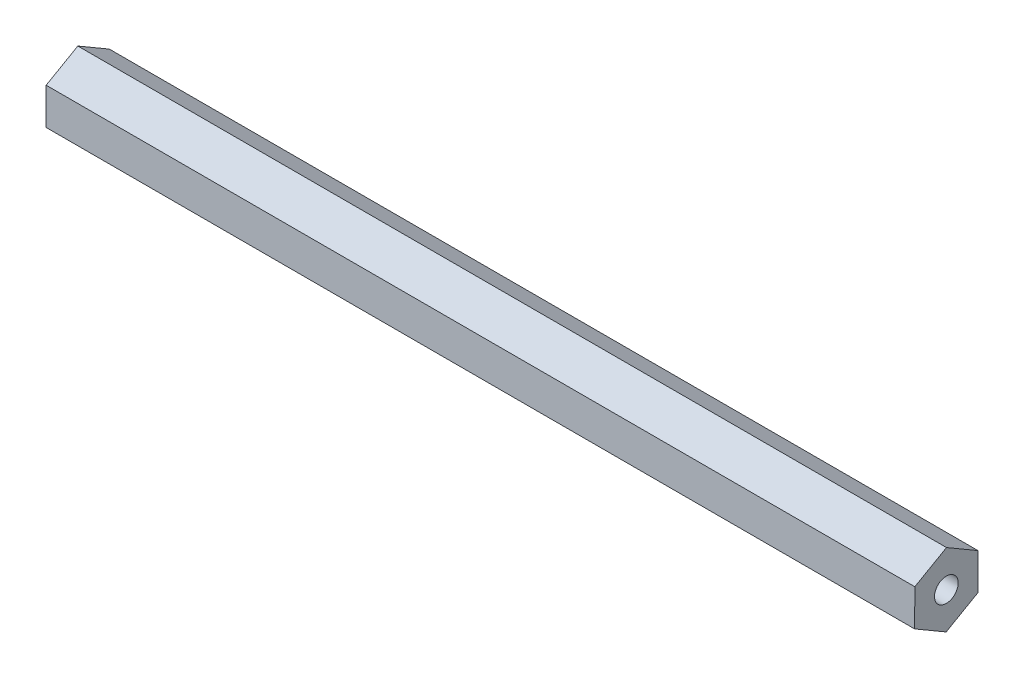
ISO-10303-21;
HEADER;
FILE_DESCRIPTION(('STEP AP214'),'2;1');
FILE_NAME('part.step','',(''),(''),'','','');
FILE_SCHEMA(('AUTOMOTIVE_DESIGN { 1 0 10303 214 1 1 1 1 }'));
ENDSEC;
DATA;
#1=APPLICATION_CONTEXT('core data for automotive mechanical design processes');
#2=APPLICATION_PROTOCOL_DEFINITION('international standard','automotive_design',2000,#1);
#3=PRODUCT_CONTEXT('',#1,'mechanical');
#4=PRODUCT('Part','Part','',(#3));
#5=PRODUCT_RELATED_PRODUCT_CATEGORY('part','',(#4));
#6=PRODUCT_DEFINITION_FORMATION('','',#4);
#7=PRODUCT_DEFINITION_CONTEXT('part definition',#1,'design');
#8=PRODUCT_DEFINITION('design','',#6,#7);
#9=PRODUCT_DEFINITION_SHAPE('','',#8);
#10=(LENGTH_UNIT() NAMED_UNIT(*) SI_UNIT(.MILLI.,.METRE.));
#11=(NAMED_UNIT(*) PLANE_ANGLE_UNIT() SI_UNIT($,.RADIAN.));
#12=(NAMED_UNIT(*) SI_UNIT($,.STERADIAN.) SOLID_ANGLE_UNIT());
#13=UNCERTAINTY_MEASURE_WITH_UNIT(LENGTH_MEASURE(1.E-05),#10,'distance_accuracy_value','');
#14=(GEOMETRIC_REPRESENTATION_CONTEXT(3) GLOBAL_UNCERTAINTY_ASSIGNED_CONTEXT((#13)) GLOBAL_UNIT_ASSIGNED_CONTEXT((#10,
#11,#12)) REPRESENTATION_CONTEXT('',''));
#15=CARTESIAN_POINT('',(0.,0.,0.));
#16=DIRECTION('',(0.,0.,1.));
#17=DIRECTION('',(1.,0.,0.));
#18=AXIS2_PLACEMENT_3D('',#15,#16,#17);
#19=CARTESIAN_POINT('',(174.625,0.,0.));
#20=DIRECTION('',(1.,0.,0.));
#21=DIRECTION('',(0.,0.,-1.));
#22=AXIS2_PLACEMENT_3D('',#19,#20,#21);
#23=PLANE('',#22);
#24=DIRECTION('',(0.,0.999990086919822,-0.00445264663856445));
#25=VECTOR('',#24,1.);
#26=CARTESIAN_POINT('',(174.625,-3.69441217243012,-6.33361287367119));
#27=LINE('',#26,#25);
#28=CARTESIAN_POINT('',(174.625,-3.69441217243012,-6.33361287367119));
#29=VERTEX_POINT('',#28);
#30=CARTESIAN_POINT('',(174.625,3.63786356012036,-6.36626123021054));
#31=VERTEX_POINT('',#30);
#32=EDGE_CURVE('E157',#29,#31,#27,.T.);
#33=ORIENTED_EDGE('',*,*,#32,.T.);
#34=DIRECTION('',(0.,0.503851148562983,0.863790495485892));
#35=VECTOR('',#34,1.);
#36=CARTESIAN_POINT('',(174.625,3.63786356012036,-6.36626123021054));
#37=LINE('',#36,#35);
#38=CARTESIAN_POINT('',(174.625,7.33227573255048,-0.0326483565393466));
#39=VERTEX_POINT('',#38);
#40=EDGE_CURVE('E114',#31,#39,#37,.T.);
#41=ORIENTED_EDGE('',*,*,#40,.T.);
#42=DIRECTION('',(0.,-0.496138938356838,0.868243142124457));
#43=VECTOR('',#42,1.);
#44=CARTESIAN_POINT('',(174.625,7.33227573255048,-0.0326483565393466));
#45=LINE('',#44,#43);
#46=CARTESIAN_POINT('',(174.625,3.69441217243012,6.33361287367119));
#47=VERTEX_POINT('',#46);
#48=EDGE_CURVE('E130',#39,#47,#45,.T.);
#49=ORIENTED_EDGE('',*,*,#48,.T.);
#50=DIRECTION('',(0.,-0.999990086919821,0.00445264663856468));
#51=VECTOR('',#50,1.);
#52=CARTESIAN_POINT('',(174.625,3.69441217243012,6.33361287367119));
#53=LINE('',#52,#51);
#54=CARTESIAN_POINT('',(174.625,-3.63786356012035,6.36626123021054));
#55=VERTEX_POINT('',#54);
#56=EDGE_CURVE('E123',#47,#55,#53,.T.);
#57=ORIENTED_EDGE('',*,*,#56,.T.);
#58=DIRECTION('',(0.,-0.503851148562983,-0.863790495485892));
#59=VECTOR('',#58,1.);
#60=CARTESIAN_POINT('',(174.625,-3.63786356012035,6.36626123021054));
#61=LINE('',#60,#59);
#62=CARTESIAN_POINT('',(174.625,-7.33227573255048,0.0326483565393424));
#63=VERTEX_POINT('',#62);
#64=EDGE_CURVE('E124',#55,#63,#61,.T.);
#65=ORIENTED_EDGE('',*,*,#64,.T.);
#66=DIRECTION('',(0.,0.496138938356839,-0.868243142124457));
#67=VECTOR('',#66,1.);
#68=CARTESIAN_POINT('',(174.625,-7.33227573255048,0.0326483565393424));
#69=LINE('',#68,#67);
#70=EDGE_CURVE('E77',#63,#29,#69,.T.);
#71=ORIENTED_EDGE('',*,*,#70,.T.);
#72=EDGE_LOOP('',(#33,#41,#49,#57,#65,#71));
#73=FACE_BOUND('',#72,.T.);
#74=CARTESIAN_POINT('',(174.625,0.,0.));
#75=DIRECTION('',(1.,0.,0.));
#76=DIRECTION('',(0.,0.,-1.));
#77=AXIS2_PLACEMENT_3D('',#74,#75,#76);
#78=CIRCLE('',#77,2.38125);
#79=CARTESIAN_POINT('',(174.625,0.,-2.38125));
#80=VERTEX_POINT('',#79);
#81=EDGE_CURVE('E146',#80,#80,#78,.T.);
#82=ORIENTED_EDGE('',*,*,#81,.F.);
#83=EDGE_LOOP('',(#82));
#84=FACE_BOUND('',#83,.T.);
#85=ADVANCED_FACE('F58',(#73,#84),#23,.T.);
#86=CARTESIAN_POINT('',(0.,0.,0.));
#87=DIRECTION('',(1.,0.,0.));
#88=DIRECTION('',(0.,0.,-1.));
#89=AXIS2_PLACEMENT_3D('',#86,#87,#88);
#90=PLANE('',#89);
#91=DIRECTION('',(0.,0.999990086919822,-0.00445264663856445));
#92=VECTOR('',#91,1.);
#93=CARTESIAN_POINT('',(0.,-3.69441217243012,-6.33361287367119));
#94=LINE('',#93,#92);
#95=CARTESIAN_POINT('',(0.,-3.69441217243012,-6.33361287367119));
#96=VERTEX_POINT('',#95);
#97=CARTESIAN_POINT('',(0.,3.63786356012036,-6.36626123021054));
#98=VERTEX_POINT('',#97);
#99=EDGE_CURVE('E144',#96,#98,#94,.T.);
#100=ORIENTED_EDGE('',*,*,#99,.F.);
#101=DIRECTION('',(0.,0.496138938356839,-0.868243142124457));
#102=VECTOR('',#101,1.);
#103=CARTESIAN_POINT('',(0.,-7.33227573255048,0.0326483565393424));
#104=LINE('',#103,#102);
#105=CARTESIAN_POINT('',(0.,-7.33227573255048,0.0326483565393424));
#106=VERTEX_POINT('',#105);
#107=EDGE_CURVE('E107',#106,#96,#104,.T.);
#108=ORIENTED_EDGE('',*,*,#107,.F.);
#109=DIRECTION('',(0.,-0.503851148562983,-0.863790495485892));
#110=VECTOR('',#109,1.);
#111=CARTESIAN_POINT('',(0.,-3.63786356012035,6.36626123021054));
#112=LINE('',#111,#110);
#113=CARTESIAN_POINT('',(0.,-3.63786356012035,6.36626123021054));
#114=VERTEX_POINT('',#113);
#115=EDGE_CURVE('E99',#114,#106,#112,.T.);
#116=ORIENTED_EDGE('',*,*,#115,.F.);
#117=DIRECTION('',(0.,-0.999990086919821,0.00445264663856468));
#118=VECTOR('',#117,1.);
#119=CARTESIAN_POINT('',(0.,3.69441217243012,6.33361287367119));
#120=LINE('',#119,#118);
#121=CARTESIAN_POINT('',(0.,3.69441217243012,6.33361287367119));
#122=VERTEX_POINT('',#121);
#123=EDGE_CURVE('E134',#122,#114,#120,.T.);
#124=ORIENTED_EDGE('',*,*,#123,.F.);
#125=DIRECTION('',(0.,-0.496138938356838,0.868243142124457));
#126=VECTOR('',#125,1.);
#127=CARTESIAN_POINT('',(0.,7.33227573255048,-0.0326483565393466));
#128=LINE('',#127,#126);
#129=CARTESIAN_POINT('',(0.,7.33227573255048,-0.0326483565393466));
#130=VERTEX_POINT('',#129);
#131=EDGE_CURVE('E152',#130,#122,#128,.T.);
#132=ORIENTED_EDGE('',*,*,#131,.F.);
#133=DIRECTION('',(0.,0.503851148562983,0.863790495485892));
#134=VECTOR('',#133,1.);
#135=CARTESIAN_POINT('',(0.,3.63786356012036,-6.36626123021054));
#136=LINE('',#135,#134);
#137=EDGE_CURVE('E149',#98,#130,#136,.T.);
#138=ORIENTED_EDGE('',*,*,#137,.F.);
#139=EDGE_LOOP('',(#100,#108,#116,#124,#132,#138));
#140=FACE_BOUND('',#139,.T.);
#141=CARTESIAN_POINT('',(0.,0.,0.));
#142=DIRECTION('',(1.,0.,0.));
#143=DIRECTION('',(0.,0.,-1.));
#144=AXIS2_PLACEMENT_3D('',#141,#142,#143);
#145=CIRCLE('',#144,2.38125);
#146=CARTESIAN_POINT('',(0.,0.,-2.38125));
#147=VERTEX_POINT('',#146);
#148=EDGE_CURVE('E249',#147,#147,#145,.T.);
#149=ORIENTED_EDGE('',*,*,#148,.T.);
#150=EDGE_LOOP('',(#149));
#151=FACE_BOUND('',#150,.T.);
#152=ADVANCED_FACE('F163',(#140,#151),#90,.F.);
#153=CARTESIAN_POINT('',(174.625,-3.69441217243012,-6.33361287367119));
#154=DIRECTION('',(0.,0.00445264663856445,0.999990086919821));
#155=DIRECTION('',(0.,-0.999990086919821,0.00445264663856445));
#156=AXIS2_PLACEMENT_3D('',#153,#154,#155);
#157=PLANE('',#156);
#158=ORIENTED_EDGE('',*,*,#99,.T.);
#159=DIRECTION('',(-1.,0.,0.));
#160=VECTOR('',#159,1.);
#161=CARTESIAN_POINT('',(174.625,3.63786356012036,-6.36626123021054));
#162=LINE('',#161,#160);
#163=EDGE_CURVE('E12',#31,#98,#162,.T.);
#164=ORIENTED_EDGE('',*,*,#163,.F.);
#165=ORIENTED_EDGE('',*,*,#32,.F.);
#166=DIRECTION('',(-1.,0.,0.));
#167=VECTOR('',#166,1.);
#168=CARTESIAN_POINT('',(174.625,-3.69441217243012,-6.33361287367119));
#169=LINE('',#168,#167);
#170=EDGE_CURVE('E141',#29,#96,#169,.T.);
#171=ORIENTED_EDGE('',*,*,#170,.T.);
#172=EDGE_LOOP('',(#158,#164,#165,#171));
#173=FACE_BOUND('',#172,.T.);
#174=ADVANCED_FACE('F64',(#173),#157,.F.);
#175=CARTESIAN_POINT('',(174.625,3.63786356012036,-6.36626123021054));
#176=DIRECTION('',(0.,-0.863790495485892,0.503851148562983));
#177=DIRECTION('',(0.,-0.503851148562983,-0.863790495485892));
#178=AXIS2_PLACEMENT_3D('',#175,#176,#177);
#179=PLANE('',#178);
#180=ORIENTED_EDGE('',*,*,#137,.T.);
#181=DIRECTION('',(-1.,0.,0.));
#182=VECTOR('',#181,1.);
#183=CARTESIAN_POINT('',(174.625,7.33227573255048,-0.0326483565393466));
#184=LINE('',#183,#182);
#185=EDGE_CURVE('E69',#39,#130,#184,.T.);
#186=ORIENTED_EDGE('',*,*,#185,.F.);
#187=ORIENTED_EDGE('',*,*,#40,.F.);
#188=ORIENTED_EDGE('',*,*,#163,.T.);
#189=EDGE_LOOP('',(#180,#186,#187,#188));
#190=FACE_BOUND('',#189,.T.);
#191=ADVANCED_FACE('F189',(#190),#179,.F.);
#192=CARTESIAN_POINT('',(174.625,7.33227573255048,-0.0326483565393466));
#193=DIRECTION('',(0.,-0.868243142124457,-0.496138938356838));
#194=DIRECTION('',(0.,0.496138938356838,-0.868243142124457));
#195=AXIS2_PLACEMENT_3D('',#192,#193,#194);
#196=PLANE('',#195);
#197=ORIENTED_EDGE('',*,*,#131,.T.);
#198=DIRECTION('',(-1.,0.,0.));
#199=VECTOR('',#198,1.);
#200=CARTESIAN_POINT('',(174.625,3.69441217243012,6.33361287367119));
#201=LINE('',#200,#199);
#202=EDGE_CURVE('E136',#47,#122,#201,.T.);
#203=ORIENTED_EDGE('',*,*,#202,.F.);
#204=ORIENTED_EDGE('',*,*,#48,.F.);
#205=ORIENTED_EDGE('',*,*,#185,.T.);
#206=EDGE_LOOP('',(#197,#203,#204,#205));
#207=FACE_BOUND('',#206,.T.);
#208=ADVANCED_FACE('F164',(#207),#196,.F.);
#209=CARTESIAN_POINT('',(174.625,3.69441217243012,6.33361287367119));
#210=DIRECTION('',(0.,-0.00445264663856468,-0.999990086919821));
#211=DIRECTION('',(0.,0.999990086919821,-0.00445264663856468));
#212=AXIS2_PLACEMENT_3D('',#209,#210,#211);
#213=PLANE('',#212);
#214=ORIENTED_EDGE('',*,*,#123,.T.);
#215=DIRECTION('',(-1.,0.,0.));
#216=VECTOR('',#215,1.);
#217=CARTESIAN_POINT('',(174.625,-3.63786356012035,6.36626123021054));
#218=LINE('',#217,#216);
#219=EDGE_CURVE('E135',#55,#114,#218,.T.);
#220=ORIENTED_EDGE('',*,*,#219,.F.);
#221=ORIENTED_EDGE('',*,*,#56,.F.);
#222=ORIENTED_EDGE('',*,*,#202,.T.);
#223=EDGE_LOOP('',(#214,#220,#221,#222));
#224=FACE_BOUND('',#223,.T.);
#225=ADVANCED_FACE('F133',(#224),#213,.F.);
#226=CARTESIAN_POINT('',(174.625,-3.63786356012035,6.36626123021054));
#227=DIRECTION('',(0.,0.863790495485892,-0.503851148562983));
#228=DIRECTION('',(0.,0.503851148562983,0.863790495485892));
#229=AXIS2_PLACEMENT_3D('',#226,#227,#228);
#230=PLANE('',#229);
#231=ORIENTED_EDGE('',*,*,#115,.T.);
#232=DIRECTION('',(-1.,0.,0.));
#233=VECTOR('',#232,1.);
#234=CARTESIAN_POINT('',(174.625,-7.33227573255048,0.0326483565393424));
#235=LINE('',#234,#233);
#236=EDGE_CURVE('E140',#63,#106,#235,.T.);
#237=ORIENTED_EDGE('',*,*,#236,.F.);
#238=ORIENTED_EDGE('',*,*,#64,.F.);
#239=ORIENTED_EDGE('',*,*,#219,.T.);
#240=EDGE_LOOP('',(#231,#237,#238,#239));
#241=FACE_BOUND('',#240,.T.);
#242=ADVANCED_FACE('F137',(#241),#230,.F.);
#243=CARTESIAN_POINT('',(174.625,-7.33227573255048,0.0326483565393424));
#244=DIRECTION('',(0.,0.868243142124457,0.496138938356839));
#245=DIRECTION('',(0.,-0.496138938356839,0.868243142124457));
#246=AXIS2_PLACEMENT_3D('',#243,#244,#245);
#247=PLANE('',#246);
#248=ORIENTED_EDGE('',*,*,#107,.T.);
#249=ORIENTED_EDGE('',*,*,#170,.F.);
#250=ORIENTED_EDGE('',*,*,#70,.F.);
#251=ORIENTED_EDGE('',*,*,#236,.T.);
#252=EDGE_LOOP('',(#248,#249,#250,#251));
#253=FACE_BOUND('',#252,.T.);
#254=ADVANCED_FACE('F169',(#253),#247,.F.);
#255=CARTESIAN_POINT('',(174.625,0.,0.));
#256=DIRECTION('',(-1.,0.,0.));
#257=DIRECTION('',(0.,0.,1.));
#258=AXIS2_PLACEMENT_3D('',#255,#256,#257);
#259=CYLINDRICAL_SURFACE('',#258,2.38125);
#260=ORIENTED_EDGE('',*,*,#81,.T.);
#261=EDGE_LOOP('',(#260));
#262=FACE_BOUND('',#261,.T.);
#263=ORIENTED_EDGE('',*,*,#148,.F.);
#264=EDGE_LOOP('',(#263));
#265=FACE_BOUND('',#264,.T.);
#266=ADVANCED_FACE('F175',(#262,#265),#259,.F.);
#267=CLOSED_SHELL('',(#85,#152,#174,#191,#208,#225,#242,#254,#266));
#268=MANIFOLD_SOLID_BREP('B2',#267);
#269=ADVANCED_BREP_SHAPE_REPRESENTATION('',(#18,#268),#14);
#270=SHAPE_DEFINITION_REPRESENTATION(#9,#269);
ENDSEC;
END-ISO-10303-21;
